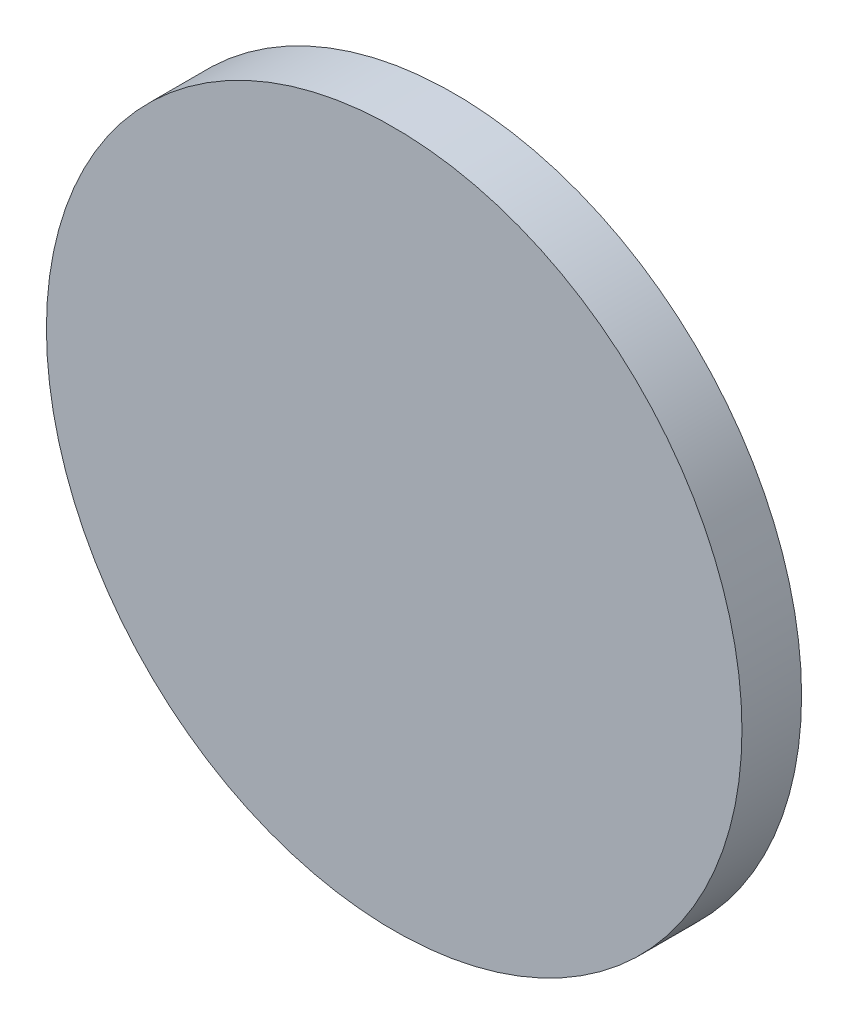
ISO-10303-21;
HEADER;
FILE_DESCRIPTION(('STEP AP214'),'2;1');
FILE_NAME('part.step','',(''),(''),'','','');
FILE_SCHEMA(('AUTOMOTIVE_DESIGN { 1 0 10303 214 1 1 1 1 }'));
ENDSEC;
DATA;
#1=APPLICATION_CONTEXT('core data for automotive mechanical design processes');
#2=APPLICATION_PROTOCOL_DEFINITION('international standard','automotive_design',2000,#1);
#3=PRODUCT_CONTEXT('',#1,'mechanical');
#4=PRODUCT('Part','Part','',(#3));
#5=PRODUCT_RELATED_PRODUCT_CATEGORY('part','',(#4));
#6=PRODUCT_DEFINITION_FORMATION('','',#4);
#7=PRODUCT_DEFINITION_CONTEXT('part definition',#1,'design');
#8=PRODUCT_DEFINITION('design','',#6,#7);
#9=PRODUCT_DEFINITION_SHAPE('','',#8);
#10=(LENGTH_UNIT() NAMED_UNIT(*) SI_UNIT(.MILLI.,.METRE.));
#11=(NAMED_UNIT(*) PLANE_ANGLE_UNIT() SI_UNIT($,.RADIAN.));
#12=(NAMED_UNIT(*) SI_UNIT($,.STERADIAN.) SOLID_ANGLE_UNIT());
#13=UNCERTAINTY_MEASURE_WITH_UNIT(LENGTH_MEASURE(1.E-05),#10,'distance_accuracy_value','');
#14=(GEOMETRIC_REPRESENTATION_CONTEXT(3) GLOBAL_UNCERTAINTY_ASSIGNED_CONTEXT((#13)) GLOBAL_UNIT_ASSIGNED_CONTEXT((#10,
#11,#12)) REPRESENTATION_CONTEXT('',''));
#15=CARTESIAN_POINT('',(0.,0.,0.));
#16=DIRECTION('',(0.,0.,1.));
#17=DIRECTION('',(1.,0.,0.));
#18=AXIS2_PLACEMENT_3D('',#15,#16,#17);
#19=CARTESIAN_POINT('',(10.80008,9.300000014875,0.));
#20=DIRECTION('',(0.,0.,-1.));
#21=DIRECTION('',(-1.,0.,0.));
#22=AXIS2_PLACEMENT_3D('',#19,#20,#21);
#23=PLANE('',#22);
#24=CARTESIAN_POINT('',(10.80008,9.300000014875,0.));
#25=DIRECTION('',(0.,0.,1.));
#26=DIRECTION('',(1.,0.,0.));
#27=AXIS2_PLACEMENT_3D('',#24,#25,#26);
#28=CIRCLE('',#27,0.200024667);
#29=CARTESIAN_POINT('',(11.000104667,9.300000014875,0.));
#30=VERTEX_POINT('',#29);
#31=EDGE_CURVE('E18',#30,#30,#28,.T.);
#32=ORIENTED_EDGE('',*,*,#31,.F.);
#33=EDGE_LOOP('',(#32));
#34=FACE_BOUND('',#33,.T.);
#35=ADVANCED_FACE('F15',(#34),#23,.T.);
#36=CARTESIAN_POINT('',(10.80008,9.300000014875,0.));
#37=DIRECTION('',(0.,0.,1.));
#38=DIRECTION('',(1.,0.,0.));
#39=AXIS2_PLACEMENT_3D('',#36,#37,#38);
#40=CYLINDRICAL_SURFACE('',#39,0.200024667);
#41=CARTESIAN_POINT('',(10.80008,9.300000014875,0.03429));
#42=DIRECTION('',(0.,0.,1.));
#43=DIRECTION('',(1.,0.,0.));
#44=AXIS2_PLACEMENT_3D('',#41,#42,#43);
#45=CIRCLE('',#44,0.200024667);
#46=CARTESIAN_POINT('',(11.000104667,9.300000014875,0.03429));
#47=VERTEX_POINT('',#46);
#48=EDGE_CURVE('E10',#47,#47,#45,.T.);
#49=ORIENTED_EDGE('',*,*,#48,.F.);
#50=EDGE_LOOP('',(#49));
#51=FACE_BOUND('',#50,.T.);
#52=ORIENTED_EDGE('',*,*,#31,.T.);
#53=EDGE_LOOP('',(#52));
#54=FACE_BOUND('',#53,.T.);
#55=ADVANCED_FACE('F27',(#51,#54),#40,.T.);
#56=CARTESIAN_POINT('',(10.80008,9.300000014875,0.03429));
#57=DIRECTION('',(0.,0.,1.));
#58=DIRECTION('',(1.,0.,0.));
#59=AXIS2_PLACEMENT_3D('',#56,#57,#58);
#60=PLANE('',#59);
#61=ORIENTED_EDGE('',*,*,#48,.T.);
#62=EDGE_LOOP('',(#61));
#63=FACE_BOUND('',#62,.T.);
#64=ADVANCED_FACE('F34',(#63),#60,.T.);
#65=CLOSED_SHELL('',(#35,#55,#64));
#66=MANIFOLD_SOLID_BREP('B1',#65);
#67=ADVANCED_BREP_SHAPE_REPRESENTATION('',(#18,#66),#14);
#68=SHAPE_DEFINITION_REPRESENTATION(#9,#67);
ENDSEC;
END-ISO-10303-21;
